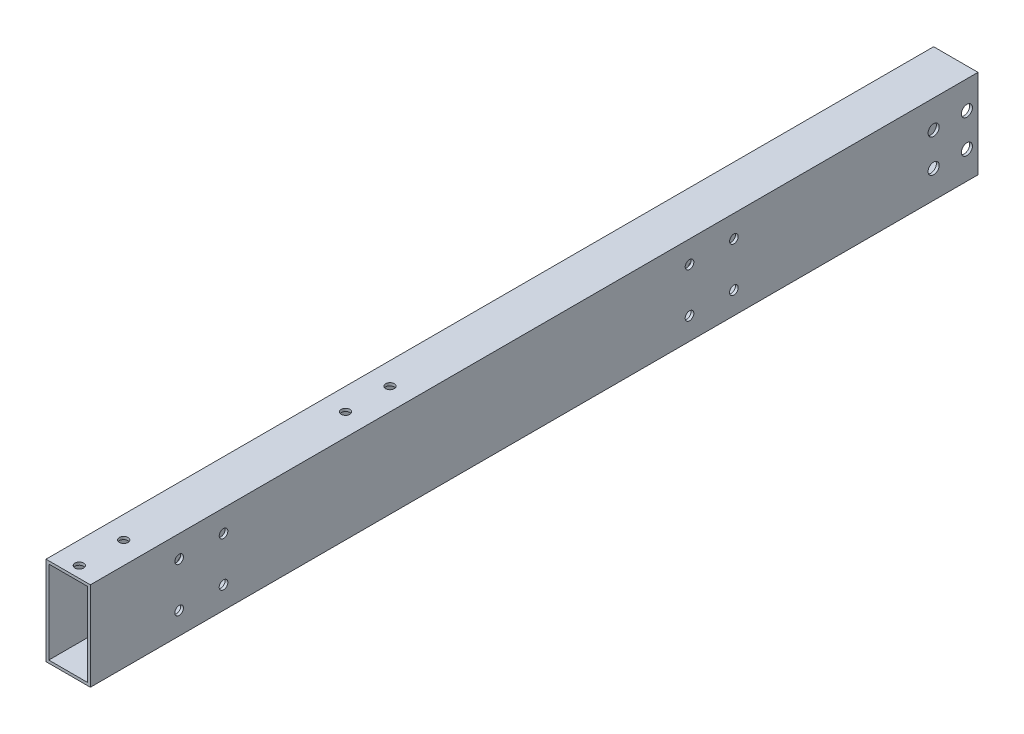
ISO-10303-21;
HEADER;
FILE_DESCRIPTION(('STEP AP214'),'2;1');
FILE_NAME('part.step','',(''),(''),'','','');
FILE_SCHEMA(('AUTOMOTIVE_DESIGN { 1 0 10303 214 1 1 1 1 }'));
ENDSEC;
DATA;
#1=APPLICATION_CONTEXT('core data for automotive mechanical design processes');
#2=APPLICATION_PROTOCOL_DEFINITION('international standard','automotive_design',2000,#1);
#3=PRODUCT_CONTEXT('',#1,'mechanical');
#4=PRODUCT('Part','Part','',(#3));
#5=PRODUCT_RELATED_PRODUCT_CATEGORY('part','',(#4));
#6=PRODUCT_DEFINITION_FORMATION('','',#4);
#7=PRODUCT_DEFINITION_CONTEXT('part definition',#1,'design');
#8=PRODUCT_DEFINITION('design','',#6,#7);
#9=PRODUCT_DEFINITION_SHAPE('','',#8);
#10=(LENGTH_UNIT() NAMED_UNIT(*) SI_UNIT(.MILLI.,.METRE.));
#11=(NAMED_UNIT(*) PLANE_ANGLE_UNIT() SI_UNIT($,.RADIAN.));
#12=(NAMED_UNIT(*) SI_UNIT($,.STERADIAN.) SOLID_ANGLE_UNIT());
#13=UNCERTAINTY_MEASURE_WITH_UNIT(LENGTH_MEASURE(1.E-05),#10,'distance_accuracy_value','');
#14=(GEOMETRIC_REPRESENTATION_CONTEXT(3) GLOBAL_UNCERTAINTY_ASSIGNED_CONTEXT((#13)) GLOBAL_UNIT_ASSIGNED_CONTEXT((#10,
#11,#12)) REPRESENTATION_CONTEXT('',''));
#15=CARTESIAN_POINT('',(0.,0.,0.));
#16=DIRECTION('',(0.,0.,1.));
#17=DIRECTION('',(1.,0.,0.));
#18=AXIS2_PLACEMENT_3D('',#15,#16,#17);
#19=CARTESIAN_POINT('',(0.,0.,508.));
#20=DIRECTION('',(0.,0.,1.));
#21=DIRECTION('',(1.,0.,0.));
#22=AXIS2_PLACEMENT_3D('',#19,#20,#21);
#23=PLANE('',#22);
#24=DIRECTION('',(0.,1.,0.));
#25=VECTOR('',#24,1.);
#26=CARTESIAN_POINT('',(12.7,-25.4,508.));
#27=LINE('',#26,#25);
#28=CARTESIAN_POINT('',(12.7,-25.4,508.));
#29=VERTEX_POINT('',#28);
#30=CARTESIAN_POINT('',(12.7,25.4,508.));
#31=VERTEX_POINT('',#30);
#32=EDGE_CURVE('E162',#29,#31,#27,.T.);
#33=ORIENTED_EDGE('',*,*,#32,.T.);
#34=DIRECTION('',(-1.,0.,0.));
#35=VECTOR('',#34,1.);
#36=CARTESIAN_POINT('',(-12.7,25.4,508.));
#37=LINE('',#36,#35);
#38=CARTESIAN_POINT('',(-12.7,25.4,508.));
#39=VERTEX_POINT('',#38);
#40=EDGE_CURVE('E165',#31,#39,#37,.T.);
#41=ORIENTED_EDGE('',*,*,#40,.T.);
#42=DIRECTION('',(0.,-1.,0.));
#43=VECTOR('',#42,1.);
#44=CARTESIAN_POINT('',(-12.7,-25.4,508.));
#45=LINE('',#44,#43);
#46=CARTESIAN_POINT('',(-12.7,-25.4,508.));
#47=VERTEX_POINT('',#46);
#48=EDGE_CURVE('E168',#39,#47,#45,.T.);
#49=ORIENTED_EDGE('',*,*,#48,.T.);
#50=DIRECTION('',(1.,0.,0.));
#51=VECTOR('',#50,1.);
#52=CARTESIAN_POINT('',(-12.7,-25.4,508.));
#53=LINE('',#52,#51);
#54=EDGE_CURVE('E170',#47,#29,#53,.T.);
#55=ORIENTED_EDGE('',*,*,#54,.T.);
#56=EDGE_LOOP('',(#33,#41,#49,#55));
#57=FACE_BOUND('',#56,.T.);
#58=DIRECTION('',(-1.,0.,0.));
#59=VECTOR('',#58,1.);
#60=CARTESIAN_POINT('',(0.,23.8125,508.));
#61=LINE('',#60,#59);
#62=CARTESIAN_POINT('',(11.1125,23.8125,508.));
#63=VERTEX_POINT('',#62);
#64=CARTESIAN_POINT('',(-11.1125,23.8125,508.));
#65=VERTEX_POINT('',#64);
#66=EDGE_CURVE('E132',#63,#65,#61,.T.);
#67=ORIENTED_EDGE('',*,*,#66,.F.);
#68=DIRECTION('',(0.,1.,0.));
#69=VECTOR('',#68,1.);
#70=CARTESIAN_POINT('',(11.1125,0.,508.));
#71=LINE('',#70,#69);
#72=CARTESIAN_POINT('',(11.1125,-23.8125,508.));
#73=VERTEX_POINT('',#72);
#74=EDGE_CURVE('E124',#73,#63,#71,.T.);
#75=ORIENTED_EDGE('',*,*,#74,.F.);
#76=DIRECTION('',(1.,0.,0.));
#77=VECTOR('',#76,1.);
#78=CARTESIAN_POINT('',(0.,-23.8125,508.));
#79=LINE('',#78,#77);
#80=CARTESIAN_POINT('',(-11.1125,-23.8125,508.));
#81=VERTEX_POINT('',#80);
#82=EDGE_CURVE('E146',#81,#73,#79,.T.);
#83=ORIENTED_EDGE('',*,*,#82,.F.);
#84=DIRECTION('',(0.,-1.,0.));
#85=VECTOR('',#84,1.);
#86=CARTESIAN_POINT('',(-11.1125,0.,508.));
#87=LINE('',#86,#85);
#88=EDGE_CURVE('E144',#65,#81,#87,.T.);
#89=ORIENTED_EDGE('',*,*,#88,.F.);
#90=EDGE_LOOP('',(#67,#75,#83,#89));
#91=FACE_BOUND('',#90,.T.);
#92=ADVANCED_FACE('F57',(#57,#91),#23,.T.);
#93=CARTESIAN_POINT('',(0.,0.,0.));
#94=DIRECTION('',(0.,0.,1.));
#95=DIRECTION('',(1.,0.,0.));
#96=AXIS2_PLACEMENT_3D('',#93,#94,#95);
#97=PLANE('',#96);
#98=DIRECTION('',(0.,1.,0.));
#99=VECTOR('',#98,1.);
#100=CARTESIAN_POINT('',(12.7,-25.4,0.));
#101=LINE('',#100,#99);
#102=CARTESIAN_POINT('',(12.7,-25.4,0.));
#103=VERTEX_POINT('',#102);
#104=CARTESIAN_POINT('',(12.7,25.4,0.));
#105=VERTEX_POINT('',#104);
#106=EDGE_CURVE('E140',#103,#105,#101,.T.);
#107=ORIENTED_EDGE('',*,*,#106,.F.);
#108=DIRECTION('',(1.,0.,0.));
#109=VECTOR('',#108,1.);
#110=CARTESIAN_POINT('',(-12.7,-25.4,0.));
#111=LINE('',#110,#109);
#112=CARTESIAN_POINT('',(-12.7,-25.4,0.));
#113=VERTEX_POINT('',#112);
#114=EDGE_CURVE('E166',#113,#103,#111,.T.);
#115=ORIENTED_EDGE('',*,*,#114,.F.);
#116=DIRECTION('',(0.,-1.,0.));
#117=VECTOR('',#116,1.);
#118=CARTESIAN_POINT('',(-12.7,-25.4,0.));
#119=LINE('',#118,#117);
#120=CARTESIAN_POINT('',(-12.7,25.4,0.));
#121=VERTEX_POINT('',#120);
#122=EDGE_CURVE('E177',#121,#113,#119,.T.);
#123=ORIENTED_EDGE('',*,*,#122,.F.);
#124=DIRECTION('',(-1.,0.,0.));
#125=VECTOR('',#124,1.);
#126=CARTESIAN_POINT('',(-12.7,25.4,0.));
#127=LINE('',#126,#125);
#128=EDGE_CURVE('E175',#105,#121,#127,.T.);
#129=ORIENTED_EDGE('',*,*,#128,.F.);
#130=EDGE_LOOP('',(#107,#115,#123,#129));
#131=FACE_BOUND('',#130,.T.);
#132=DIRECTION('',(0.,1.,0.));
#133=VECTOR('',#132,1.);
#134=CARTESIAN_POINT('',(11.1125,0.,0.));
#135=LINE('',#134,#133);
#136=CARTESIAN_POINT('',(11.1125,-23.8125,0.));
#137=VERTEX_POINT('',#136);
#138=CARTESIAN_POINT('',(11.1125,23.8125,0.));
#139=VERTEX_POINT('',#138);
#140=EDGE_CURVE('E82',#137,#139,#135,.T.);
#141=ORIENTED_EDGE('',*,*,#140,.T.);
#142=DIRECTION('',(-1.,0.,0.));
#143=VECTOR('',#142,1.);
#144=CARTESIAN_POINT('',(0.,23.8125,0.));
#145=LINE('',#144,#143);
#146=CARTESIAN_POINT('',(-11.1125,23.8125,0.));
#147=VERTEX_POINT('',#146);
#148=EDGE_CURVE('E139',#139,#147,#145,.T.);
#149=ORIENTED_EDGE('',*,*,#148,.T.);
#150=DIRECTION('',(0.,-1.,0.));
#151=VECTOR('',#150,1.);
#152=CARTESIAN_POINT('',(-11.1125,0.,0.));
#153=LINE('',#152,#151);
#154=CARTESIAN_POINT('',(-11.1125,-23.8125,0.));
#155=VERTEX_POINT('',#154);
#156=EDGE_CURVE('E154',#147,#155,#153,.T.);
#157=ORIENTED_EDGE('',*,*,#156,.T.);
#158=DIRECTION('',(1.,0.,0.));
#159=VECTOR('',#158,1.);
#160=CARTESIAN_POINT('',(0.,-23.8125,0.));
#161=LINE('',#160,#159);
#162=EDGE_CURVE('E133',#155,#137,#161,.T.);
#163=ORIENTED_EDGE('',*,*,#162,.T.);
#164=EDGE_LOOP('',(#141,#149,#157,#163));
#165=FACE_BOUND('',#164,.T.);
#166=ADVANCED_FACE('F253',(#131,#165),#97,.F.);
#167=CARTESIAN_POINT('',(12.7,-25.4,508.));
#168=DIRECTION('',(-1.,0.,0.));
#169=DIRECTION('',(0.,0.,1.));
#170=AXIS2_PLACEMENT_3D('',#167,#168,#169);
#171=PLANE('',#170);
#172=CARTESIAN_POINT('',(12.7,-9.525,25.4));
#173=DIRECTION('',(1.,0.,0.));
#174=DIRECTION('',(0.,0.,-1.));
#175=AXIS2_PLACEMENT_3D('',#172,#173,#174);
#176=CIRCLE('',#175,3.175);
#177=CARTESIAN_POINT('',(12.7,-9.525,22.225));
#178=VERTEX_POINT('',#177);
#179=EDGE_CURVE('E488',#178,#178,#176,.T.);
#180=ORIENTED_EDGE('',*,*,#179,.F.);
#181=EDGE_LOOP('',(#180));
#182=FACE_BOUND('',#181,.T.);
#183=CARTESIAN_POINT('',(12.7,-9.525,6.35));
#184=DIRECTION('',(1.,0.,0.));
#185=DIRECTION('',(0.,0.,-1.));
#186=AXIS2_PLACEMENT_3D('',#183,#184,#185);
#187=CIRCLE('',#186,3.175);
#188=CARTESIAN_POINT('',(12.7,-9.525,3.175));
#189=VERTEX_POINT('',#188);
#190=EDGE_CURVE('E482',#189,#189,#187,.T.);
#191=ORIENTED_EDGE('',*,*,#190,.F.);
#192=EDGE_LOOP('',(#191));
#193=FACE_BOUND('',#192,.T.);
#194=CARTESIAN_POINT('',(12.7,9.525,6.35));
#195=DIRECTION('',(1.,0.,0.));
#196=DIRECTION('',(0.,0.,-1.));
#197=AXIS2_PLACEMENT_3D('',#194,#195,#196);
#198=CIRCLE('',#197,3.175);
#199=CARTESIAN_POINT('',(12.7,9.525,3.175));
#200=VERTEX_POINT('',#199);
#201=EDGE_CURVE('E476',#200,#200,#198,.T.);
#202=ORIENTED_EDGE('',*,*,#201,.F.);
#203=EDGE_LOOP('',(#202));
#204=FACE_BOUND('',#203,.T.);
#205=CARTESIAN_POINT('',(12.7,9.525,25.4));
#206=DIRECTION('',(1.,0.,0.));
#207=DIRECTION('',(0.,0.,-1.));
#208=AXIS2_PLACEMENT_3D('',#205,#206,#207);
#209=CIRCLE('',#208,3.175);
#210=CARTESIAN_POINT('',(12.7,9.525,22.225));
#211=VERTEX_POINT('',#210);
#212=EDGE_CURVE('E327',#211,#211,#209,.T.);
#213=ORIENTED_EDGE('',*,*,#212,.F.);
#214=EDGE_LOOP('',(#213));
#215=FACE_BOUND('',#214,.T.);
#216=CARTESIAN_POINT('',(12.7,12.6999999999999,165.1));
#217=DIRECTION('',(1.,0.,0.));
#218=DIRECTION('',(0.,0.,-1.));
#219=AXIS2_PLACEMENT_3D('',#216,#217,#218);
#220=CIRCLE('',#219,2.4765);
#221=CARTESIAN_POINT('',(12.7,12.6999999999999,162.6235));
#222=VERTEX_POINT('',#221);
#223=EDGE_CURVE('E334',#222,#222,#220,.T.);
#224=ORIENTED_EDGE('',*,*,#223,.F.);
#225=EDGE_LOOP('',(#224));
#226=FACE_BOUND('',#225,.T.);
#227=CARTESIAN_POINT('',(12.7,-12.7000000000001,457.2));
#228=DIRECTION('',(1.,0.,0.));
#229=DIRECTION('',(0.,0.,-1.));
#230=AXIS2_PLACEMENT_3D('',#227,#228,#229);
#231=CIRCLE('',#230,2.47650000000003);
#232=CARTESIAN_POINT('',(12.7,-12.7000000000001,454.7235));
#233=VERTEX_POINT('',#232);
#234=EDGE_CURVE('E354',#233,#233,#231,.T.);
#235=ORIENTED_EDGE('',*,*,#234,.F.);
#236=EDGE_LOOP('',(#235));
#237=FACE_BOUND('',#236,.T.);
#238=CARTESIAN_POINT('',(12.7,-12.7000000000001,431.8));
#239=DIRECTION('',(1.,0.,0.));
#240=DIRECTION('',(0.,0.,-1.));
#241=AXIS2_PLACEMENT_3D('',#238,#239,#240);
#242=CIRCLE('',#241,2.47650000000003);
#243=CARTESIAN_POINT('',(12.7,-12.7000000000001,429.3235));
#244=VERTEX_POINT('',#243);
#245=EDGE_CURVE('E353',#244,#244,#242,.T.);
#246=ORIENTED_EDGE('',*,*,#245,.F.);
#247=EDGE_LOOP('',(#246));
#248=FACE_BOUND('',#247,.T.);
#249=CARTESIAN_POINT('',(12.7,12.6999999999999,431.8));
#250=DIRECTION('',(1.,0.,0.));
#251=DIRECTION('',(0.,0.,-1.));
#252=AXIS2_PLACEMENT_3D('',#249,#250,#251);
#253=CIRCLE('',#252,2.47649999999997);
#254=CARTESIAN_POINT('',(12.7,12.6999999999999,429.3235));
#255=VERTEX_POINT('',#254);
#256=EDGE_CURVE('E366',#255,#255,#253,.T.);
#257=ORIENTED_EDGE('',*,*,#256,.F.);
#258=EDGE_LOOP('',(#257));
#259=FACE_BOUND('',#258,.T.);
#260=CARTESIAN_POINT('',(12.7,12.6999999999999,139.7));
#261=DIRECTION('',(1.,0.,0.));
#262=DIRECTION('',(0.,0.,-1.));
#263=AXIS2_PLACEMENT_3D('',#260,#261,#262);
#264=CIRCLE('',#263,2.4765);
#265=CARTESIAN_POINT('',(12.7,12.6999999999999,137.2235));
#266=VERTEX_POINT('',#265);
#267=EDGE_CURVE('E335',#266,#266,#264,.T.);
#268=ORIENTED_EDGE('',*,*,#267,.F.);
#269=EDGE_LOOP('',(#268));
#270=FACE_BOUND('',#269,.T.);
#271=CARTESIAN_POINT('',(12.7,-12.7,139.7));
#272=DIRECTION('',(1.,0.,0.));
#273=DIRECTION('',(0.,0.,-1.));
#274=AXIS2_PLACEMENT_3D('',#271,#272,#273);
#275=CIRCLE('',#274,2.4765);
#276=CARTESIAN_POINT('',(12.7,-12.7,137.2235));
#277=VERTEX_POINT('',#276);
#278=EDGE_CURVE('E341',#277,#277,#275,.T.);
#279=ORIENTED_EDGE('',*,*,#278,.F.);
#280=EDGE_LOOP('',(#279));
#281=FACE_BOUND('',#280,.T.);
#282=CARTESIAN_POINT('',(12.7,-12.7000000000001,165.1));
#283=DIRECTION('',(1.,0.,0.));
#284=DIRECTION('',(0.,0.,-1.));
#285=AXIS2_PLACEMENT_3D('',#282,#283,#284);
#286=CIRCLE('',#285,2.4765);
#287=CARTESIAN_POINT('',(12.7,-12.7000000000001,162.6235));
#288=VERTEX_POINT('',#287);
#289=EDGE_CURVE('E347',#288,#288,#286,.T.);
#290=ORIENTED_EDGE('',*,*,#289,.F.);
#291=EDGE_LOOP('',(#290));
#292=FACE_BOUND('',#291,.T.);
#293=CARTESIAN_POINT('',(12.7,12.6999999999999,457.2));
#294=DIRECTION('',(1.,0.,0.));
#295=DIRECTION('',(0.,0.,-1.));
#296=AXIS2_PLACEMENT_3D('',#293,#294,#295);
#297=CIRCLE('',#296,2.47649999999997);
#298=CARTESIAN_POINT('',(12.7,12.6999999999999,454.7235));
#299=VERTEX_POINT('',#298);
#300=EDGE_CURVE('E365',#299,#299,#297,.T.);
#301=ORIENTED_EDGE('',*,*,#300,.F.);
#302=EDGE_LOOP('',(#301));
#303=FACE_BOUND('',#302,.T.);
#304=ORIENTED_EDGE('',*,*,#106,.T.);
#305=DIRECTION('',(0.,0.,-1.));
#306=VECTOR('',#305,1.);
#307=CARTESIAN_POINT('',(12.7,25.4,508.));
#308=LINE('',#307,#306);
#309=EDGE_CURVE('E12',#31,#105,#308,.T.);
#310=ORIENTED_EDGE('',*,*,#309,.F.);
#311=ORIENTED_EDGE('',*,*,#32,.F.);
#312=DIRECTION('',(0.,0.,-1.));
#313=VECTOR('',#312,1.);
#314=CARTESIAN_POINT('',(12.7,-25.4,508.));
#315=LINE('',#314,#313);
#316=EDGE_CURVE('E172',#29,#103,#315,.T.);
#317=ORIENTED_EDGE('',*,*,#316,.T.);
#318=EDGE_LOOP('',(#304,#310,#311,#317));
#319=FACE_BOUND('',#318,.T.);
#320=ADVANCED_FACE('F59',(#182,#193,#204,#215,#226,#237,#248,#259,#270,#281,#292,#303,#319),
#171,.F.);
#321=CARTESIAN_POINT('',(-12.7,25.4,508.));
#322=DIRECTION('',(0.,-1.,0.));
#323=DIRECTION('',(0.,0.,-1.));
#324=AXIS2_PLACEMENT_3D('',#321,#322,#323);
#325=PLANE('',#324);
#326=CARTESIAN_POINT('',(-7.39356136396108E-13,25.4,323.85));
#327=DIRECTION('',(0.,1.,0.));
#328=DIRECTION('',(0.,0.,1.));
#329=AXIS2_PLACEMENT_3D('',#326,#327,#328);
#330=CIRCLE('',#329,2.48920000000003);
#331=CARTESIAN_POINT('',(-7.39356136396108E-13,25.4,326.3392));
#332=VERTEX_POINT('',#331);
#333=EDGE_CURVE('E295',#332,#332,#330,.T.);
#334=ORIENTED_EDGE('',*,*,#333,.F.);
#335=EDGE_LOOP('',(#334));
#336=FACE_BOUND('',#335,.T.);
#337=CARTESIAN_POINT('',(-7.36245533526274E-13,25.4,349.25));
#338=DIRECTION('',(0.,1.,0.));
#339=DIRECTION('',(0.,0.,1.));
#340=AXIS2_PLACEMENT_3D('',#337,#338,#339);
#341=CIRCLE('',#340,2.48920000000003);
#342=CARTESIAN_POINT('',(-7.36245533526274E-13,25.4,351.7392));
#343=VERTEX_POINT('',#342);
#344=EDGE_CURVE('E299',#343,#343,#341,.T.);
#345=ORIENTED_EDGE('',*,*,#344,.F.);
#346=EDGE_LOOP('',(#345));
#347=FACE_BOUND('',#346,.T.);
#348=CARTESIAN_POINT('',(-7.20687893247834E-13,25.4,476.25));
#349=DIRECTION('',(0.,1.,0.));
#350=DIRECTION('',(0.,0.,1.));
#351=AXIS2_PLACEMENT_3D('',#348,#349,#350);
#352=CIRCLE('',#351,2.48920000000003);
#353=CARTESIAN_POINT('',(-7.20687893247834E-13,25.4,478.7392));
#354=VERTEX_POINT('',#353);
#355=EDGE_CURVE('E303',#354,#354,#352,.T.);
#356=ORIENTED_EDGE('',*,*,#355,.F.);
#357=EDGE_LOOP('',(#356));
#358=FACE_BOUND('',#357,.T.);
#359=CARTESIAN_POINT('',(-7.17577290377999E-13,25.4,501.65));
#360=DIRECTION('',(0.,1.,0.));
#361=DIRECTION('',(0.,0.,1.));
#362=AXIS2_PLACEMENT_3D('',#359,#360,#361);
#363=CIRCLE('',#362,2.48920000000009);
#364=CARTESIAN_POINT('',(-7.17577290377999E-13,25.4,504.1392));
#365=VERTEX_POINT('',#364);
#366=EDGE_CURVE('E307',#365,#365,#363,.T.);
#367=ORIENTED_EDGE('',*,*,#366,.F.);
#368=EDGE_LOOP('',(#367));
#369=FACE_BOUND('',#368,.T.);
#370=ORIENTED_EDGE('',*,*,#128,.T.);
#371=DIRECTION('',(0.,0.,-1.));
#372=VECTOR('',#371,1.);
#373=CARTESIAN_POINT('',(-12.7,25.4,508.));
#374=LINE('',#373,#372);
#375=EDGE_CURVE('E66',#39,#121,#374,.T.);
#376=ORIENTED_EDGE('',*,*,#375,.F.);
#377=ORIENTED_EDGE('',*,*,#40,.F.);
#378=ORIENTED_EDGE('',*,*,#309,.T.);
#379=EDGE_LOOP('',(#370,#376,#377,#378));
#380=FACE_BOUND('',#379,.T.);
#381=ADVANCED_FACE('F282',(#336,#347,#358,#369,#380),#325,.F.);
#382=CARTESIAN_POINT('',(-12.7,-25.4,508.));
#383=DIRECTION('',(1.,0.,0.));
#384=DIRECTION('',(0.,0.,-1.));
#385=AXIS2_PLACEMENT_3D('',#382,#383,#384);
#386=PLANE('',#385);
#387=CARTESIAN_POINT('',(-12.7,12.6999999999999,165.1));
#388=DIRECTION('',(1.,0.,0.));
#389=DIRECTION('',(0.,0.,-1.));
#390=AXIS2_PLACEMENT_3D('',#387,#388,#389);
#391=CIRCLE('',#390,2.4765);
#392=CARTESIAN_POINT('',(-12.7,12.6999999999999,162.6235));
#393=VERTEX_POINT('',#392);
#394=EDGE_CURVE('E357',#393,#393,#391,.T.);
#395=ORIENTED_EDGE('',*,*,#394,.T.);
#396=EDGE_LOOP('',(#395));
#397=FACE_BOUND('',#396,.T.);
#398=CARTESIAN_POINT('',(-12.7,-12.7000000000001,457.2));
#399=DIRECTION('',(1.,0.,0.));
#400=DIRECTION('',(0.,0.,-1.));
#401=AXIS2_PLACEMENT_3D('',#398,#399,#400);
#402=CIRCLE('',#401,2.47650000000003);
#403=CARTESIAN_POINT('',(-12.7,-12.7000000000001,454.7235));
#404=VERTEX_POINT('',#403);
#405=EDGE_CURVE('E350',#404,#404,#402,.T.);
#406=ORIENTED_EDGE('',*,*,#405,.T.);
#407=EDGE_LOOP('',(#406));
#408=FACE_BOUND('',#407,.T.);
#409=CARTESIAN_POINT('',(-12.7,-12.7000000000001,431.8));
#410=DIRECTION('',(1.,0.,0.));
#411=DIRECTION('',(0.,0.,-1.));
#412=AXIS2_PLACEMENT_3D('',#409,#410,#411);
#413=CIRCLE('',#412,2.47650000000003);
#414=CARTESIAN_POINT('',(-12.7,-12.7000000000001,429.3235));
#415=VERTEX_POINT('',#414);
#416=EDGE_CURVE('E369',#415,#415,#413,.T.);
#417=ORIENTED_EDGE('',*,*,#416,.T.);
#418=EDGE_LOOP('',(#417));
#419=FACE_BOUND('',#418,.T.);
#420=CARTESIAN_POINT('',(-12.7,12.6999999999999,431.8));
#421=DIRECTION('',(1.,0.,0.));
#422=DIRECTION('',(0.,0.,-1.));
#423=AXIS2_PLACEMENT_3D('',#420,#421,#422);
#424=CIRCLE('',#423,2.47649999999997);
#425=CARTESIAN_POINT('',(-12.7,12.6999999999999,429.3235));
#426=VERTEX_POINT('',#425);
#427=EDGE_CURVE('E362',#426,#426,#424,.T.);
#428=ORIENTED_EDGE('',*,*,#427,.T.);
#429=EDGE_LOOP('',(#428));
#430=FACE_BOUND('',#429,.T.);
#431=CARTESIAN_POINT('',(-12.7,12.6999999999999,139.7));
#432=DIRECTION('',(1.,0.,0.));
#433=DIRECTION('',(0.,0.,-1.));
#434=AXIS2_PLACEMENT_3D('',#431,#432,#433);
#435=CIRCLE('',#434,2.4765);
#436=CARTESIAN_POINT('',(-12.7,12.6999999999999,137.2235));
#437=VERTEX_POINT('',#436);
#438=EDGE_CURVE('E331',#437,#437,#435,.T.);
#439=ORIENTED_EDGE('',*,*,#438,.T.);
#440=EDGE_LOOP('',(#439));
#441=FACE_BOUND('',#440,.T.);
#442=CARTESIAN_POINT('',(-12.7,-12.7,139.7));
#443=DIRECTION('',(1.,0.,0.));
#444=DIRECTION('',(0.,0.,-1.));
#445=AXIS2_PLACEMENT_3D('',#442,#443,#444);
#446=CIRCLE('',#445,2.4765);
#447=CARTESIAN_POINT('',(-12.7,-12.7,137.2235));
#448=VERTEX_POINT('',#447);
#449=EDGE_CURVE('E338',#448,#448,#446,.T.);
#450=ORIENTED_EDGE('',*,*,#449,.T.);
#451=EDGE_LOOP('',(#450));
#452=FACE_BOUND('',#451,.T.);
#453=CARTESIAN_POINT('',(-12.7,-12.7000000000001,165.1));
#454=DIRECTION('',(1.,0.,0.));
#455=DIRECTION('',(0.,0.,-1.));
#456=AXIS2_PLACEMENT_3D('',#453,#454,#455);
#457=CIRCLE('',#456,2.4765);
#458=CARTESIAN_POINT('',(-12.7,-12.7000000000001,162.6235));
#459=VERTEX_POINT('',#458);
#460=EDGE_CURVE('E344',#459,#459,#457,.T.);
#461=ORIENTED_EDGE('',*,*,#460,.T.);
#462=EDGE_LOOP('',(#461));
#463=FACE_BOUND('',#462,.T.);
#464=CARTESIAN_POINT('',(-12.7,12.6999999999999,457.2));
#465=DIRECTION('',(1.,0.,0.));
#466=DIRECTION('',(0.,0.,-1.));
#467=AXIS2_PLACEMENT_3D('',#464,#465,#466);
#468=CIRCLE('',#467,2.47649999999997);
#469=CARTESIAN_POINT('',(-12.7,12.6999999999999,454.7235));
#470=VERTEX_POINT('',#469);
#471=EDGE_CURVE('E191',#470,#470,#468,.T.);
#472=ORIENTED_EDGE('',*,*,#471,.T.);
#473=EDGE_LOOP('',(#472));
#474=FACE_BOUND('',#473,.T.);
#475=ORIENTED_EDGE('',*,*,#122,.T.);
#476=DIRECTION('',(0.,0.,-1.));
#477=VECTOR('',#476,1.);
#478=CARTESIAN_POINT('',(-12.7,-25.4,508.));
#479=LINE('',#478,#477);
#480=EDGE_CURVE('E182',#47,#113,#479,.T.);
#481=ORIENTED_EDGE('',*,*,#480,.F.);
#482=ORIENTED_EDGE('',*,*,#48,.F.);
#483=ORIENTED_EDGE('',*,*,#375,.T.);
#484=EDGE_LOOP('',(#475,#481,#482,#483));
#485=FACE_BOUND('',#484,.T.);
#486=ADVANCED_FACE('F279',(#397,#408,#419,#430,#441,#452,#463,#474,#485),#386,.F.);
#487=CARTESIAN_POINT('',(-12.7,-25.4,508.));
#488=DIRECTION('',(0.,1.,0.));
#489=DIRECTION('',(0.,0.,1.));
#490=AXIS2_PLACEMENT_3D('',#487,#488,#489);
#491=PLANE('',#490);
#492=ORIENTED_EDGE('',*,*,#114,.T.);
#493=ORIENTED_EDGE('',*,*,#316,.F.);
#494=ORIENTED_EDGE('',*,*,#54,.F.);
#495=ORIENTED_EDGE('',*,*,#480,.T.);
#496=EDGE_LOOP('',(#492,#493,#494,#495));
#497=FACE_BOUND('',#496,.T.);
#498=ADVANCED_FACE('F276',(#497),#491,.F.);
#499=CARTESIAN_POINT('',(11.1125,0.,508.));
#500=DIRECTION('',(-1.,0.,0.));
#501=DIRECTION('',(0.,0.,1.));
#502=AXIS2_PLACEMENT_3D('',#499,#500,#501);
#503=PLANE('',#502);
#504=CARTESIAN_POINT('',(11.1125,-9.525,25.4));
#505=DIRECTION('',(-1.,0.,0.));
#506=DIRECTION('',(0.,0.,1.));
#507=AXIS2_PLACEMENT_3D('',#504,#505,#506);
#508=CIRCLE('',#507,3.175);
#509=CARTESIAN_POINT('',(11.1125,-9.525,28.575));
#510=VERTEX_POINT('',#509);
#511=EDGE_CURVE('E491',#510,#510,#508,.F.);
#512=ORIENTED_EDGE('',*,*,#511,.T.);
#513=EDGE_LOOP('',(#512));
#514=FACE_BOUND('',#513,.T.);
#515=CARTESIAN_POINT('',(11.1125,-9.525,6.35));
#516=DIRECTION('',(-1.,0.,0.));
#517=DIRECTION('',(0.,0.,1.));
#518=AXIS2_PLACEMENT_3D('',#515,#516,#517);
#519=CIRCLE('',#518,3.175);
#520=CARTESIAN_POINT('',(11.1125,-9.525,9.525));
#521=VERTEX_POINT('',#520);
#522=EDGE_CURVE('E485',#521,#521,#519,.F.);
#523=ORIENTED_EDGE('',*,*,#522,.T.);
#524=EDGE_LOOP('',(#523));
#525=FACE_BOUND('',#524,.T.);
#526=CARTESIAN_POINT('',(11.1125,9.525,6.35));
#527=DIRECTION('',(-1.,0.,0.));
#528=DIRECTION('',(0.,0.,1.));
#529=AXIS2_PLACEMENT_3D('',#526,#527,#528);
#530=CIRCLE('',#529,3.175);
#531=CARTESIAN_POINT('',(11.1125,9.525,9.525));
#532=VERTEX_POINT('',#531);
#533=EDGE_CURVE('E473',#532,#532,#530,.F.);
#534=ORIENTED_EDGE('',*,*,#533,.T.);
#535=EDGE_LOOP('',(#534));
#536=FACE_BOUND('',#535,.T.);
#537=CARTESIAN_POINT('',(11.1125,9.525,25.4));
#538=DIRECTION('',(-1.,0.,0.));
#539=DIRECTION('',(0.,0.,1.));
#540=AXIS2_PLACEMENT_3D('',#537,#538,#539);
#541=CIRCLE('',#540,3.175);
#542=CARTESIAN_POINT('',(11.1125,9.525,28.575));
#543=VERTEX_POINT('',#542);
#544=EDGE_CURVE('E478',#543,#543,#541,.F.);
#545=ORIENTED_EDGE('',*,*,#544,.T.);
#546=EDGE_LOOP('',(#545));
#547=FACE_BOUND('',#546,.T.);
#548=CARTESIAN_POINT('',(11.1125,12.6999999999999,165.1));
#549=DIRECTION('',(-1.,0.,0.));
#550=DIRECTION('',(0.,0.,1.));
#551=AXIS2_PLACEMENT_3D('',#548,#549,#550);
#552=CIRCLE('',#551,2.4765);
#553=CARTESIAN_POINT('',(11.1125,12.6999999999999,167.5765));
#554=VERTEX_POINT('',#553);
#555=EDGE_CURVE('E152',#554,#554,#552,.T.);
#556=ORIENTED_EDGE('',*,*,#555,.F.);
#557=EDGE_LOOP('',(#556));
#558=FACE_BOUND('',#557,.T.);
#559=CARTESIAN_POINT('',(11.1125,-12.7000000000001,457.2));
#560=DIRECTION('',(-1.,0.,0.));
#561=DIRECTION('',(0.,0.,1.));
#562=AXIS2_PLACEMENT_3D('',#559,#560,#561);
#563=CIRCLE('',#562,2.47650000000003);
#564=CARTESIAN_POINT('',(11.1125,-12.7000000000001,459.6765));
#565=VERTEX_POINT('',#564);
#566=EDGE_CURVE('E213',#565,#565,#563,.T.);
#567=ORIENTED_EDGE('',*,*,#566,.F.);
#568=EDGE_LOOP('',(#567));
#569=FACE_BOUND('',#568,.T.);
#570=CARTESIAN_POINT('',(11.1125,-12.7000000000001,431.8));
#571=DIRECTION('',(-1.,0.,0.));
#572=DIRECTION('',(0.,0.,1.));
#573=AXIS2_PLACEMENT_3D('',#570,#571,#572);
#574=CIRCLE('',#573,2.47650000000003);
#575=CARTESIAN_POINT('',(11.1125,-12.7000000000001,434.2765));
#576=VERTEX_POINT('',#575);
#577=EDGE_CURVE('E210',#576,#576,#574,.T.);
#578=ORIENTED_EDGE('',*,*,#577,.F.);
#579=EDGE_LOOP('',(#578));
#580=FACE_BOUND('',#579,.T.);
#581=CARTESIAN_POINT('',(11.1125,12.6999999999999,431.8));
#582=DIRECTION('',(-1.,0.,0.));
#583=DIRECTION('',(0.,0.,1.));
#584=AXIS2_PLACEMENT_3D('',#581,#582,#583);
#585=CIRCLE('',#584,2.47649999999997);
#586=CARTESIAN_POINT('',(11.1125,12.6999999999999,434.2765));
#587=VERTEX_POINT('',#586);
#588=EDGE_CURVE('E207',#587,#587,#585,.T.);
#589=ORIENTED_EDGE('',*,*,#588,.F.);
#590=EDGE_LOOP('',(#589));
#591=FACE_BOUND('',#590,.T.);
#592=CARTESIAN_POINT('',(11.1125,12.6999999999999,139.7));
#593=DIRECTION('',(-1.,0.,0.));
#594=DIRECTION('',(0.,0.,1.));
#595=AXIS2_PLACEMENT_3D('',#592,#593,#594);
#596=CIRCLE('',#595,2.4765);
#597=CARTESIAN_POINT('',(11.1125,12.6999999999999,142.1765));
#598=VERTEX_POINT('',#597);
#599=EDGE_CURVE('E203',#598,#598,#596,.T.);
#600=ORIENTED_EDGE('',*,*,#599,.F.);
#601=EDGE_LOOP('',(#600));
#602=FACE_BOUND('',#601,.T.);
#603=CARTESIAN_POINT('',(11.1125,-12.7,139.7));
#604=DIRECTION('',(-1.,0.,0.));
#605=DIRECTION('',(0.,0.,1.));
#606=AXIS2_PLACEMENT_3D('',#603,#604,#605);
#607=CIRCLE('',#606,2.4765);
#608=CARTESIAN_POINT('',(11.1125,-12.7,142.1765));
#609=VERTEX_POINT('',#608);
#610=EDGE_CURVE('E199',#609,#609,#607,.T.);
#611=ORIENTED_EDGE('',*,*,#610,.F.);
#612=EDGE_LOOP('',(#611));
#613=FACE_BOUND('',#612,.T.);
#614=CARTESIAN_POINT('',(11.1125,-12.7000000000001,165.1));
#615=DIRECTION('',(-1.,0.,0.));
#616=DIRECTION('',(0.,0.,1.));
#617=AXIS2_PLACEMENT_3D('',#614,#615,#616);
#618=CIRCLE('',#617,2.4765);
#619=CARTESIAN_POINT('',(11.1125,-12.7000000000001,167.5765));
#620=VERTEX_POINT('',#619);
#621=EDGE_CURVE('E195',#620,#620,#618,.T.);
#622=ORIENTED_EDGE('',*,*,#621,.F.);
#623=EDGE_LOOP('',(#622));
#624=FACE_BOUND('',#623,.T.);
#625=CARTESIAN_POINT('',(11.1125,12.6999999999999,457.2));
#626=DIRECTION('',(-1.,0.,0.));
#627=DIRECTION('',(0.,0.,1.));
#628=AXIS2_PLACEMENT_3D('',#625,#626,#627);
#629=CIRCLE('',#628,2.47649999999997);
#630=CARTESIAN_POINT('',(11.1125,12.6999999999999,459.6765));
#631=VERTEX_POINT('',#630);
#632=EDGE_CURVE('E190',#631,#631,#629,.T.);
#633=ORIENTED_EDGE('',*,*,#632,.F.);
#634=EDGE_LOOP('',(#633));
#635=FACE_BOUND('',#634,.T.);
#636=ORIENTED_EDGE('',*,*,#140,.F.);
#637=DIRECTION('',(0.,0.,-1.));
#638=VECTOR('',#637,1.);
#639=CARTESIAN_POINT('',(11.1125,-23.8125,508.));
#640=LINE('',#639,#638);
#641=EDGE_CURVE('E128',#73,#137,#640,.T.);
#642=ORIENTED_EDGE('',*,*,#641,.F.);
#643=ORIENTED_EDGE('',*,*,#74,.T.);
#644=DIRECTION('',(0.,0.,-1.));
#645=VECTOR('',#644,1.);
#646=CARTESIAN_POINT('',(11.1125,23.8125,508.));
#647=LINE('',#646,#645);
#648=EDGE_CURVE('E127',#63,#139,#647,.T.);
#649=ORIENTED_EDGE('',*,*,#648,.T.);
#650=EDGE_LOOP('',(#636,#642,#643,#649));
#651=FACE_BOUND('',#650,.T.);
#652=ADVANCED_FACE('F126',(#514,#525,#536,#547,#558,#569,#580,#591,#602,#613,#624,#635,#651),
#503,.T.);
#653=CARTESIAN_POINT('',(0.,23.8125,508.));
#654=DIRECTION('',(0.,-1.,0.));
#655=DIRECTION('',(0.,0.,-1.));
#656=AXIS2_PLACEMENT_3D('',#653,#654,#655);
#657=PLANE('',#656);
#658=CARTESIAN_POINT('',(-7.39356136396108E-13,23.8125,323.85));
#659=DIRECTION('',(0.,-1.,0.));
#660=DIRECTION('',(0.,0.,-1.));
#661=AXIS2_PLACEMENT_3D('',#658,#659,#660);
#662=CIRCLE('',#661,2.48920000000003);
#663=CARTESIAN_POINT('',(-7.39356136396108E-13,23.8125,321.3608));
#664=VERTEX_POINT('',#663);
#665=EDGE_CURVE('E498',#664,#664,#662,.F.);
#666=ORIENTED_EDGE('',*,*,#665,.T.);
#667=EDGE_LOOP('',(#666));
#668=FACE_BOUND('',#667,.T.);
#669=CARTESIAN_POINT('',(-7.36245533526274E-13,23.8125,349.25));
#670=DIRECTION('',(0.,-1.,0.));
#671=DIRECTION('',(0.,0.,-1.));
#672=AXIS2_PLACEMENT_3D('',#669,#670,#671);
#673=CIRCLE('',#672,2.48920000000003);
#674=CARTESIAN_POINT('',(-7.36245533526274E-13,23.8125,346.7608));
#675=VERTEX_POINT('',#674);
#676=EDGE_CURVE('E502',#675,#675,#673,.F.);
#677=ORIENTED_EDGE('',*,*,#676,.T.);
#678=EDGE_LOOP('',(#677));
#679=FACE_BOUND('',#678,.T.);
#680=CARTESIAN_POINT('',(-7.20687893247834E-13,23.8125,476.25));
#681=DIRECTION('',(0.,-1.,0.));
#682=DIRECTION('',(0.,0.,-1.));
#683=AXIS2_PLACEMENT_3D('',#680,#681,#682);
#684=CIRCLE('',#683,2.48920000000003);
#685=CARTESIAN_POINT('',(-7.20687893247834E-13,23.8125,473.7608));
#686=VERTEX_POINT('',#685);
#687=EDGE_CURVE('E321',#686,#686,#684,.F.);
#688=ORIENTED_EDGE('',*,*,#687,.T.);
#689=EDGE_LOOP('',(#688));
#690=FACE_BOUND('',#689,.T.);
#691=CARTESIAN_POINT('',(-7.17577290377999E-13,23.8125,501.65));
#692=DIRECTION('',(0.,-1.,0.));
#693=DIRECTION('',(0.,0.,-1.));
#694=AXIS2_PLACEMENT_3D('',#691,#692,#693);
#695=CIRCLE('',#694,2.48920000000009);
#696=CARTESIAN_POINT('',(-7.17577290377999E-13,23.8125,499.1608));
#697=VERTEX_POINT('',#696);
#698=EDGE_CURVE('E322',#697,#697,#695,.F.);
#699=ORIENTED_EDGE('',*,*,#698,.T.);
#700=EDGE_LOOP('',(#699));
#701=FACE_BOUND('',#700,.T.);
#702=ORIENTED_EDGE('',*,*,#148,.F.);
#703=ORIENTED_EDGE('',*,*,#648,.F.);
#704=ORIENTED_EDGE('',*,*,#66,.T.);
#705=DIRECTION('',(0.,0.,-1.));
#706=VECTOR('',#705,1.);
#707=CARTESIAN_POINT('',(-11.1125,23.8125,508.));
#708=LINE('',#707,#706);
#709=EDGE_CURVE('E141',#65,#147,#708,.T.);
#710=ORIENTED_EDGE('',*,*,#709,.T.);
#711=EDGE_LOOP('',(#702,#703,#704,#710));
#712=FACE_BOUND('',#711,.T.);
#713=ADVANCED_FACE('F136',(#668,#679,#690,#701,#712),#657,.T.);
#714=CARTESIAN_POINT('',(-11.1125,0.,508.));
#715=DIRECTION('',(1.,0.,0.));
#716=DIRECTION('',(0.,0.,-1.));
#717=AXIS2_PLACEMENT_3D('',#714,#715,#716);
#718=PLANE('',#717);
#719=CARTESIAN_POINT('',(-11.1125,12.6999999999999,165.1));
#720=DIRECTION('',(1.,0.,0.));
#721=DIRECTION('',(0.,0.,-1.));
#722=AXIS2_PLACEMENT_3D('',#719,#720,#721);
#723=CIRCLE('',#722,2.4765);
#724=CARTESIAN_POINT('',(-11.1125,12.6999999999999,162.6235));
#725=VERTEX_POINT('',#724);
#726=EDGE_CURVE('E61',#725,#725,#723,.T.);
#727=ORIENTED_EDGE('',*,*,#726,.F.);
#728=EDGE_LOOP('',(#727));
#729=FACE_BOUND('',#728,.T.);
#730=CARTESIAN_POINT('',(-11.1125,-12.7000000000001,457.2));
#731=DIRECTION('',(1.,0.,0.));
#732=DIRECTION('',(0.,0.,-1.));
#733=AXIS2_PLACEMENT_3D('',#730,#731,#732);
#734=CIRCLE('',#733,2.47650000000003);
#735=CARTESIAN_POINT('',(-11.1125,-12.7000000000001,454.7235));
#736=VERTEX_POINT('',#735);
#737=EDGE_CURVE('E211',#736,#736,#734,.T.);
#738=ORIENTED_EDGE('',*,*,#737,.F.);
#739=EDGE_LOOP('',(#738));
#740=FACE_BOUND('',#739,.T.);
#741=CARTESIAN_POINT('',(-11.1125,-12.7000000000001,431.8));
#742=DIRECTION('',(1.,0.,0.));
#743=DIRECTION('',(0.,0.,-1.));
#744=AXIS2_PLACEMENT_3D('',#741,#742,#743);
#745=CIRCLE('',#744,2.47650000000003);
#746=CARTESIAN_POINT('',(-11.1125,-12.7000000000001,429.3235));
#747=VERTEX_POINT('',#746);
#748=EDGE_CURVE('E208',#747,#747,#745,.T.);
#749=ORIENTED_EDGE('',*,*,#748,.F.);
#750=EDGE_LOOP('',(#749));
#751=FACE_BOUND('',#750,.T.);
#752=CARTESIAN_POINT('',(-11.1125,12.6999999999999,431.8));
#753=DIRECTION('',(1.,0.,0.));
#754=DIRECTION('',(0.,0.,-1.));
#755=AXIS2_PLACEMENT_3D('',#752,#753,#754);
#756=CIRCLE('',#755,2.47649999999997);
#757=CARTESIAN_POINT('',(-11.1125,12.6999999999999,429.3235));
#758=VERTEX_POINT('',#757);
#759=EDGE_CURVE('E204',#758,#758,#756,.T.);
#760=ORIENTED_EDGE('',*,*,#759,.F.);
#761=EDGE_LOOP('',(#760));
#762=FACE_BOUND('',#761,.T.);
#763=CARTESIAN_POINT('',(-11.1125,12.6999999999999,139.7));
#764=DIRECTION('',(1.,0.,0.));
#765=DIRECTION('',(0.,0.,-1.));
#766=AXIS2_PLACEMENT_3D('',#763,#764,#765);
#767=CIRCLE('',#766,2.4765);
#768=CARTESIAN_POINT('',(-11.1125,12.6999999999999,137.2235));
#769=VERTEX_POINT('',#768);
#770=EDGE_CURVE('E200',#769,#769,#767,.T.);
#771=ORIENTED_EDGE('',*,*,#770,.F.);
#772=EDGE_LOOP('',(#771));
#773=FACE_BOUND('',#772,.T.);
#774=CARTESIAN_POINT('',(-11.1125,-12.7,139.7));
#775=DIRECTION('',(1.,0.,0.));
#776=DIRECTION('',(0.,0.,-1.));
#777=AXIS2_PLACEMENT_3D('',#774,#775,#776);
#778=CIRCLE('',#777,2.4765);
#779=CARTESIAN_POINT('',(-11.1125,-12.7,137.2235));
#780=VERTEX_POINT('',#779);
#781=EDGE_CURVE('E196',#780,#780,#778,.T.);
#782=ORIENTED_EDGE('',*,*,#781,.F.);
#783=EDGE_LOOP('',(#782));
#784=FACE_BOUND('',#783,.T.);
#785=CARTESIAN_POINT('',(-11.1125,-12.7000000000001,165.1));
#786=DIRECTION('',(1.,0.,0.));
#787=DIRECTION('',(0.,0.,-1.));
#788=AXIS2_PLACEMENT_3D('',#785,#786,#787);
#789=CIRCLE('',#788,2.4765);
#790=CARTESIAN_POINT('',(-11.1125,-12.7000000000001,162.6235));
#791=VERTEX_POINT('',#790);
#792=EDGE_CURVE('E192',#791,#791,#789,.T.);
#793=ORIENTED_EDGE('',*,*,#792,.F.);
#794=EDGE_LOOP('',(#793));
#795=FACE_BOUND('',#794,.T.);
#796=CARTESIAN_POINT('',(-11.1125,12.6999999999999,457.2));
#797=DIRECTION('',(1.,0.,0.));
#798=DIRECTION('',(0.,0.,-1.));
#799=AXIS2_PLACEMENT_3D('',#796,#797,#798);
#800=CIRCLE('',#799,2.47649999999997);
#801=CARTESIAN_POINT('',(-11.1125,12.6999999999999,454.7235));
#802=VERTEX_POINT('',#801);
#803=EDGE_CURVE('E187',#802,#802,#800,.T.);
#804=ORIENTED_EDGE('',*,*,#803,.F.);
#805=EDGE_LOOP('',(#804));
#806=FACE_BOUND('',#805,.T.);
#807=ORIENTED_EDGE('',*,*,#156,.F.);
#808=ORIENTED_EDGE('',*,*,#709,.F.);
#809=ORIENTED_EDGE('',*,*,#88,.T.);
#810=DIRECTION('',(0.,0.,-1.));
#811=VECTOR('',#810,1.);
#812=CARTESIAN_POINT('',(-11.1125,-23.8125,508.));
#813=LINE('',#812,#811);
#814=EDGE_CURVE('E74',#81,#155,#813,.T.);
#815=ORIENTED_EDGE('',*,*,#814,.T.);
#816=EDGE_LOOP('',(#807,#808,#809,#815));
#817=FACE_BOUND('',#816,.T.);
#818=ADVANCED_FACE('F233',(#729,#740,#751,#762,#773,#784,#795,#806,#817),#718,.T.);
#819=CARTESIAN_POINT('',(0.,-23.8125,508.));
#820=DIRECTION('',(0.,1.,0.));
#821=DIRECTION('',(0.,0.,1.));
#822=AXIS2_PLACEMENT_3D('',#819,#820,#821);
#823=PLANE('',#822);
#824=ORIENTED_EDGE('',*,*,#162,.F.);
#825=ORIENTED_EDGE('',*,*,#814,.F.);
#826=ORIENTED_EDGE('',*,*,#82,.T.);
#827=ORIENTED_EDGE('',*,*,#641,.T.);
#828=EDGE_LOOP('',(#824,#825,#826,#827));
#829=FACE_BOUND('',#828,.T.);
#830=ADVANCED_FACE('F236',(#829),#823,.T.);
#831=CARTESIAN_POINT('',(-12.7,12.6999999999999,457.2));
#832=DIRECTION('',(1.,0.,0.));
#833=DIRECTION('',(0.,0.,-1.));
#834=AXIS2_PLACEMENT_3D('',#831,#832,#833);
#835=CYLINDRICAL_SURFACE('',#834,2.47649999999997);
#836=ORIENTED_EDGE('',*,*,#803,.T.);
#837=EDGE_LOOP('',(#836));
#838=FACE_BOUND('',#837,.T.);
#839=ORIENTED_EDGE('',*,*,#471,.F.);
#840=EDGE_LOOP('',(#839));
#841=FACE_BOUND('',#840,.T.);
#842=ADVANCED_FACE('F255',(#838,#841),#835,.F.);
#843=CARTESIAN_POINT('',(-12.7,-12.7000000000001,165.1));
#844=DIRECTION('',(1.,0.,0.));
#845=DIRECTION('',(0.,0.,-1.));
#846=AXIS2_PLACEMENT_3D('',#843,#844,#845);
#847=CYLINDRICAL_SURFACE('',#846,2.4765);
#848=ORIENTED_EDGE('',*,*,#792,.T.);
#849=EDGE_LOOP('',(#848));
#850=FACE_BOUND('',#849,.T.);
#851=ORIENTED_EDGE('',*,*,#460,.F.);
#852=EDGE_LOOP('',(#851));
#853=FACE_BOUND('',#852,.T.);
#854=ADVANCED_FACE('F261',(#850,#853),#847,.F.);
#855=CARTESIAN_POINT('',(-12.7,-12.7,139.7));
#856=DIRECTION('',(1.,0.,0.));
#857=DIRECTION('',(0.,0.,-1.));
#858=AXIS2_PLACEMENT_3D('',#855,#856,#857);
#859=CYLINDRICAL_SURFACE('',#858,2.4765);
#860=ORIENTED_EDGE('',*,*,#781,.T.);
#861=EDGE_LOOP('',(#860));
#862=FACE_BOUND('',#861,.T.);
#863=ORIENTED_EDGE('',*,*,#449,.F.);
#864=EDGE_LOOP('',(#863));
#865=FACE_BOUND('',#864,.T.);
#866=ADVANCED_FACE('F429',(#862,#865),#859,.F.);
#867=CARTESIAN_POINT('',(-12.7,12.6999999999999,139.7));
#868=DIRECTION('',(1.,0.,0.));
#869=DIRECTION('',(0.,0.,-1.));
#870=AXIS2_PLACEMENT_3D('',#867,#868,#869);
#871=CYLINDRICAL_SURFACE('',#870,2.4765);
#872=ORIENTED_EDGE('',*,*,#770,.T.);
#873=EDGE_LOOP('',(#872));
#874=FACE_BOUND('',#873,.T.);
#875=ORIENTED_EDGE('',*,*,#438,.F.);
#876=EDGE_LOOP('',(#875));
#877=FACE_BOUND('',#876,.T.);
#878=ADVANCED_FACE('F421',(#874,#877),#871,.F.);
#879=CARTESIAN_POINT('',(-12.7,12.6999999999999,431.8));
#880=DIRECTION('',(1.,0.,0.));
#881=DIRECTION('',(0.,0.,-1.));
#882=AXIS2_PLACEMENT_3D('',#879,#880,#881);
#883=CYLINDRICAL_SURFACE('',#882,2.47649999999997);
#884=ORIENTED_EDGE('',*,*,#759,.T.);
#885=EDGE_LOOP('',(#884));
#886=FACE_BOUND('',#885,.T.);
#887=ORIENTED_EDGE('',*,*,#427,.F.);
#888=EDGE_LOOP('',(#887));
#889=FACE_BOUND('',#888,.T.);
#890=ADVANCED_FACE('F417',(#886,#889),#883,.F.);
#891=CARTESIAN_POINT('',(-12.7,-12.7000000000001,431.8));
#892=DIRECTION('',(1.,0.,0.));
#893=DIRECTION('',(0.,0.,-1.));
#894=AXIS2_PLACEMENT_3D('',#891,#892,#893);
#895=CYLINDRICAL_SURFACE('',#894,2.47650000000003);
#896=ORIENTED_EDGE('',*,*,#748,.T.);
#897=EDGE_LOOP('',(#896));
#898=FACE_BOUND('',#897,.T.);
#899=ORIENTED_EDGE('',*,*,#416,.F.);
#900=EDGE_LOOP('',(#899));
#901=FACE_BOUND('',#900,.T.);
#902=ADVANCED_FACE('F414',(#898,#901),#895,.F.);
#903=CARTESIAN_POINT('',(-12.7,-12.7000000000001,457.2));
#904=DIRECTION('',(1.,0.,0.));
#905=DIRECTION('',(0.,0.,-1.));
#906=AXIS2_PLACEMENT_3D('',#903,#904,#905);
#907=CYLINDRICAL_SURFACE('',#906,2.47650000000003);
#908=ORIENTED_EDGE('',*,*,#737,.T.);
#909=EDGE_LOOP('',(#908));
#910=FACE_BOUND('',#909,.T.);
#911=ORIENTED_EDGE('',*,*,#405,.F.);
#912=EDGE_LOOP('',(#911));
#913=FACE_BOUND('',#912,.T.);
#914=ADVANCED_FACE('F410',(#910,#913),#907,.F.);
#915=CARTESIAN_POINT('',(-12.7,12.6999999999999,165.1));
#916=DIRECTION('',(1.,0.,0.));
#917=DIRECTION('',(0.,0.,-1.));
#918=AXIS2_PLACEMENT_3D('',#915,#916,#917);
#919=CYLINDRICAL_SURFACE('',#918,2.4765);
#920=ORIENTED_EDGE('',*,*,#726,.T.);
#921=EDGE_LOOP('',(#920));
#922=FACE_BOUND('',#921,.T.);
#923=ORIENTED_EDGE('',*,*,#394,.F.);
#924=EDGE_LOOP('',(#923));
#925=FACE_BOUND('',#924,.T.);
#926=ADVANCED_FACE('F230',(#922,#925),#919,.F.);
#927=ORIENTED_EDGE('',*,*,#632,.T.);
#928=EDGE_LOOP('',(#927));
#929=FACE_BOUND('',#928,.T.);
#930=ORIENTED_EDGE('',*,*,#300,.T.);
#931=EDGE_LOOP('',(#930));
#932=FACE_BOUND('',#931,.T.);
#933=ADVANCED_FACE('F264',(#929,#932),#835,.F.);
#934=ORIENTED_EDGE('',*,*,#621,.T.);
#935=EDGE_LOOP('',(#934));
#936=FACE_BOUND('',#935,.T.);
#937=ORIENTED_EDGE('',*,*,#289,.T.);
#938=EDGE_LOOP('',(#937));
#939=FACE_BOUND('',#938,.T.);
#940=ADVANCED_FACE('F400',(#936,#939),#847,.F.);
#941=ORIENTED_EDGE('',*,*,#610,.T.);
#942=EDGE_LOOP('',(#941));
#943=FACE_BOUND('',#942,.T.);
#944=ORIENTED_EDGE('',*,*,#278,.T.);
#945=EDGE_LOOP('',(#944));
#946=FACE_BOUND('',#945,.T.);
#947=ADVANCED_FACE('F407',(#943,#946),#859,.F.);
#948=ORIENTED_EDGE('',*,*,#599,.T.);
#949=EDGE_LOOP('',(#948));
#950=FACE_BOUND('',#949,.T.);
#951=ORIENTED_EDGE('',*,*,#267,.T.);
#952=EDGE_LOOP('',(#951));
#953=FACE_BOUND('',#952,.T.);
#954=ADVANCED_FACE('F386',(#950,#953),#871,.F.);
#955=ORIENTED_EDGE('',*,*,#588,.T.);
#956=EDGE_LOOP('',(#955));
#957=FACE_BOUND('',#956,.T.);
#958=ORIENTED_EDGE('',*,*,#256,.T.);
#959=EDGE_LOOP('',(#958));
#960=FACE_BOUND('',#959,.T.);
#961=ADVANCED_FACE('F423',(#957,#960),#883,.F.);
#962=ORIENTED_EDGE('',*,*,#577,.T.);
#963=EDGE_LOOP('',(#962));
#964=FACE_BOUND('',#963,.T.);
#965=ORIENTED_EDGE('',*,*,#245,.T.);
#966=EDGE_LOOP('',(#965));
#967=FACE_BOUND('',#966,.T.);
#968=ADVANCED_FACE('F419',(#964,#967),#895,.F.);
#969=ORIENTED_EDGE('',*,*,#566,.T.);
#970=EDGE_LOOP('',(#969));
#971=FACE_BOUND('',#970,.T.);
#972=ORIENTED_EDGE('',*,*,#234,.T.);
#973=EDGE_LOOP('',(#972));
#974=FACE_BOUND('',#973,.T.);
#975=ADVANCED_FACE('F426',(#971,#974),#907,.F.);
#976=ORIENTED_EDGE('',*,*,#555,.T.);
#977=EDGE_LOOP('',(#976));
#978=FACE_BOUND('',#977,.T.);
#979=ORIENTED_EDGE('',*,*,#223,.T.);
#980=EDGE_LOOP('',(#979));
#981=FACE_BOUND('',#980,.T.);
#982=ADVANCED_FACE('F412',(#978,#981),#919,.F.);
#983=CARTESIAN_POINT('',(-7.17577290377999E-13,-25.401,501.65));
#984=DIRECTION('',(0.,1.,0.));
#985=DIRECTION('',(0.,0.,1.));
#986=AXIS2_PLACEMENT_3D('',#983,#984,#985);
#987=CYLINDRICAL_SURFACE('',#986,2.48920000000009);
#988=ORIENTED_EDGE('',*,*,#698,.F.);
#989=EDGE_LOOP('',(#988));
#990=FACE_BOUND('',#989,.T.);
#991=ORIENTED_EDGE('',*,*,#366,.T.);
#992=EDGE_LOOP('',(#991));
#993=FACE_BOUND('',#992,.T.);
#994=ADVANCED_FACE('F437',(#990,#993),#987,.F.);
#995=CARTESIAN_POINT('',(-7.20687893247834E-13,-25.401,476.25));
#996=DIRECTION('',(0.,1.,0.));
#997=DIRECTION('',(0.,0.,1.));
#998=AXIS2_PLACEMENT_3D('',#995,#996,#997);
#999=CYLINDRICAL_SURFACE('',#998,2.48920000000003);
#1000=ORIENTED_EDGE('',*,*,#687,.F.);
#1001=EDGE_LOOP('',(#1000));
#1002=FACE_BOUND('',#1001,.T.);
#1003=ORIENTED_EDGE('',*,*,#355,.T.);
#1004=EDGE_LOOP('',(#1003));
#1005=FACE_BOUND('',#1004,.T.);
#1006=ADVANCED_FACE('F440',(#1002,#1005),#999,.F.);
#1007=CARTESIAN_POINT('',(-7.36245533526274E-13,-25.401,349.25));
#1008=DIRECTION('',(0.,1.,0.));
#1009=DIRECTION('',(0.,0.,1.));
#1010=AXIS2_PLACEMENT_3D('',#1007,#1008,#1009);
#1011=CYLINDRICAL_SURFACE('',#1010,2.48920000000003);
#1012=ORIENTED_EDGE('',*,*,#676,.F.);
#1013=EDGE_LOOP('',(#1012));
#1014=FACE_BOUND('',#1013,.T.);
#1015=ORIENTED_EDGE('',*,*,#344,.T.);
#1016=EDGE_LOOP('',(#1015));
#1017=FACE_BOUND('',#1016,.T.);
#1018=ADVANCED_FACE('F444',(#1014,#1017),#1011,.F.);
#1019=CARTESIAN_POINT('',(-7.39356136396108E-13,-25.401,323.85));
#1020=DIRECTION('',(0.,1.,0.));
#1021=DIRECTION('',(0.,0.,1.));
#1022=AXIS2_PLACEMENT_3D('',#1019,#1020,#1021);
#1023=CYLINDRICAL_SURFACE('',#1022,2.48920000000003);
#1024=ORIENTED_EDGE('',*,*,#665,.F.);
#1025=EDGE_LOOP('',(#1024));
#1026=FACE_BOUND('',#1025,.T.);
#1027=ORIENTED_EDGE('',*,*,#333,.T.);
#1028=EDGE_LOOP('',(#1027));
#1029=FACE_BOUND('',#1028,.T.);
#1030=ADVANCED_FACE('F448',(#1026,#1029),#1023,.F.);
#1031=CARTESIAN_POINT('',(-12.701,9.525,25.4));
#1032=DIRECTION('',(1.,0.,0.));
#1033=DIRECTION('',(0.,0.,-1.));
#1034=AXIS2_PLACEMENT_3D('',#1031,#1032,#1033);
#1035=CYLINDRICAL_SURFACE('',#1034,3.175);
#1036=ORIENTED_EDGE('',*,*,#544,.F.);
#1037=EDGE_LOOP('',(#1036));
#1038=FACE_BOUND('',#1037,.T.);
#1039=ORIENTED_EDGE('',*,*,#212,.T.);
#1040=EDGE_LOOP('',(#1039));
#1041=FACE_BOUND('',#1040,.T.);
#1042=ADVANCED_FACE('F452',(#1038,#1041),#1035,.F.);
#1043=CARTESIAN_POINT('',(-12.701,9.525,6.35));
#1044=DIRECTION('',(1.,0.,0.));
#1045=DIRECTION('',(0.,0.,-1.));
#1046=AXIS2_PLACEMENT_3D('',#1043,#1044,#1045);
#1047=CYLINDRICAL_SURFACE('',#1046,3.175);
#1048=ORIENTED_EDGE('',*,*,#533,.F.);
#1049=EDGE_LOOP('',(#1048));
#1050=FACE_BOUND('',#1049,.T.);
#1051=ORIENTED_EDGE('',*,*,#201,.T.);
#1052=EDGE_LOOP('',(#1051));
#1053=FACE_BOUND('',#1052,.T.);
#1054=ADVANCED_FACE('F456',(#1050,#1053),#1047,.F.);
#1055=CARTESIAN_POINT('',(-12.701,-9.525,6.35));
#1056=DIRECTION('',(1.,0.,0.));
#1057=DIRECTION('',(0.,0.,-1.));
#1058=AXIS2_PLACEMENT_3D('',#1055,#1056,#1057);
#1059=CYLINDRICAL_SURFACE('',#1058,3.175);
#1060=ORIENTED_EDGE('',*,*,#522,.F.);
#1061=EDGE_LOOP('',(#1060));
#1062=FACE_BOUND('',#1061,.T.);
#1063=ORIENTED_EDGE('',*,*,#190,.T.);
#1064=EDGE_LOOP('',(#1063));
#1065=FACE_BOUND('',#1064,.T.);
#1066=ADVANCED_FACE('F461',(#1062,#1065),#1059,.F.);
#1067=CARTESIAN_POINT('',(-12.701,-9.525,25.4));
#1068=DIRECTION('',(1.,0.,0.));
#1069=DIRECTION('',(0.,0.,-1.));
#1070=AXIS2_PLACEMENT_3D('',#1067,#1068,#1069);
#1071=CYLINDRICAL_SURFACE('',#1070,3.175);
#1072=ORIENTED_EDGE('',*,*,#511,.F.);
#1073=EDGE_LOOP('',(#1072));
#1074=FACE_BOUND('',#1073,.T.);
#1075=ORIENTED_EDGE('',*,*,#179,.T.);
#1076=EDGE_LOOP('',(#1075));
#1077=FACE_BOUND('',#1076,.T.);
#1078=ADVANCED_FACE('F458',(#1074,#1077),#1071,.F.);
#1079=CLOSED_SHELL('',(#92,#166,#320,#381,#486,#498,#652,#713,#818,#830,#842,#854,#866,#878,
#890,#902,#914,#926,#933,#940,#947,#954,#961,#968,#975,#982,#994,#1006,#1018,#1030,#1042,#1054,
#1066,#1078));
#1080=MANIFOLD_SOLID_BREP('B2',#1079);
#1081=ADVANCED_BREP_SHAPE_REPRESENTATION('',(#18,#1080),#14);
#1082=SHAPE_DEFINITION_REPRESENTATION(#9,#1081);
ENDSEC;
END-ISO-10303-21;
